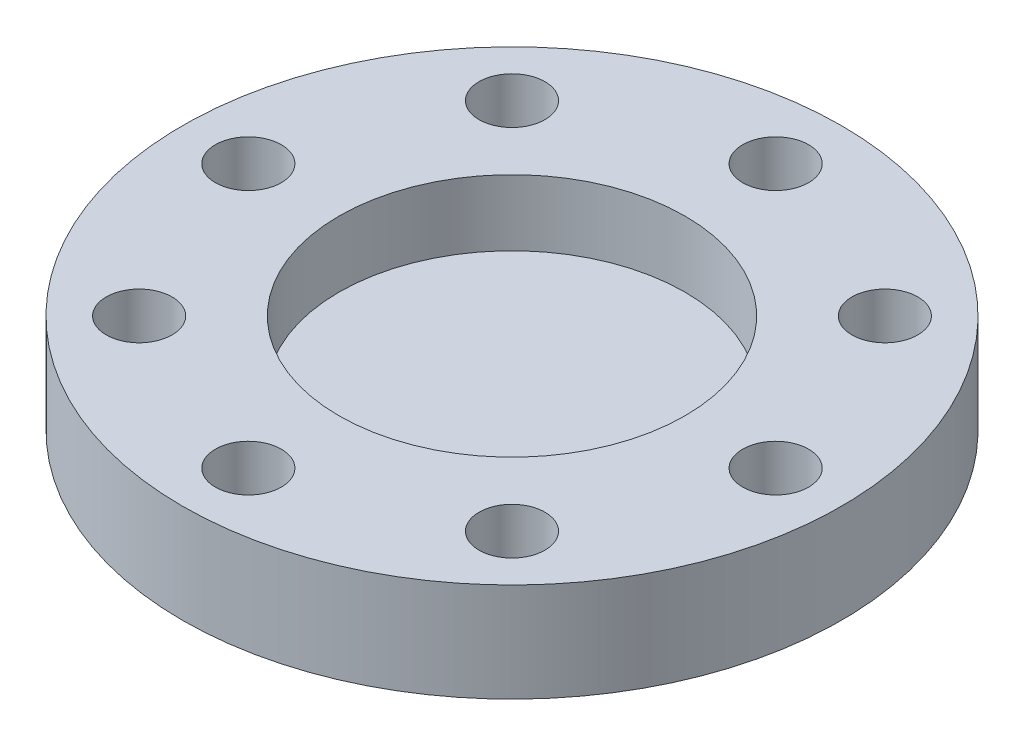
ISO-10303-21;
HEADER;
FILE_DESCRIPTION(('STEP AP214'),'2;1');
FILE_NAME('part.step','',(''),(''),'','','');
FILE_SCHEMA(('AUTOMOTIVE_DESIGN { 1 0 10303 214 1 1 1 1 }'));
ENDSEC;
DATA;
#1=APPLICATION_CONTEXT('core data for automotive mechanical design processes');
#2=APPLICATION_PROTOCOL_DEFINITION('international standard','automotive_design',2000,#1);
#3=PRODUCT_CONTEXT('',#1,'mechanical');
#4=PRODUCT('Part','Part','',(#3));
#5=PRODUCT_RELATED_PRODUCT_CATEGORY('part','',(#4));
#6=PRODUCT_DEFINITION_FORMATION('','',#4);
#7=PRODUCT_DEFINITION_CONTEXT('part definition',#1,'design');
#8=PRODUCT_DEFINITION('design','',#6,#7);
#9=PRODUCT_DEFINITION_SHAPE('','',#8);
#10=(LENGTH_UNIT() NAMED_UNIT(*) SI_UNIT(.MILLI.,.METRE.));
#11=(NAMED_UNIT(*) PLANE_ANGLE_UNIT() SI_UNIT($,.RADIAN.));
#12=(NAMED_UNIT(*) SI_UNIT($,.STERADIAN.) SOLID_ANGLE_UNIT());
#13=UNCERTAINTY_MEASURE_WITH_UNIT(LENGTH_MEASURE(1.E-05),#10,'distance_accuracy_value','');
#14=(GEOMETRIC_REPRESENTATION_CONTEXT(3) GLOBAL_UNCERTAINTY_ASSIGNED_CONTEXT((#13)) GLOBAL_UNIT_ASSIGNED_CONTEXT((#10,
#11,#12)) REPRESENTATION_CONTEXT('',''));
#15=CARTESIAN_POINT('',(0.,0.,0.));
#16=DIRECTION('',(0.,0.,1.));
#17=DIRECTION('',(1.,0.,0.));
#18=AXIS2_PLACEMENT_3D('',#15,#16,#17);
#19=CARTESIAN_POINT('',(0.,-3.,0.));
#20=DIRECTION('',(0.,1.,0.));
#21=DIRECTION('',(0.,0.,1.));
#22=AXIS2_PLACEMENT_3D('',#19,#20,#21);
#23=CYLINDRICAL_SURFACE('',#22,10.);
#24=CARTESIAN_POINT('',(0.,-3.,0.));
#25=DIRECTION('',(0.,1.,0.));
#26=DIRECTION('',(0.,0.,1.));
#27=AXIS2_PLACEMENT_3D('',#24,#25,#26);
#28=CIRCLE('',#27,10.);
#29=CARTESIAN_POINT('',(0.,-3.,10.));
#30=VERTEX_POINT('',#29);
#31=EDGE_CURVE('E10',#30,#30,#28,.T.);
#32=ORIENTED_EDGE('',*,*,#31,.T.);
#33=EDGE_LOOP('',(#32));
#34=FACE_BOUND('',#33,.T.);
#35=CARTESIAN_POINT('',(0.,0.,0.));
#36=DIRECTION('',(0.,1.,0.));
#37=DIRECTION('',(0.,0.,1.));
#38=AXIS2_PLACEMENT_3D('',#35,#36,#37);
#39=CIRCLE('',#38,10.);
#40=CARTESIAN_POINT('',(0.,0.,10.));
#41=VERTEX_POINT('',#40);
#42=EDGE_CURVE('E42',#41,#41,#39,.T.);
#43=ORIENTED_EDGE('',*,*,#42,.F.);
#44=EDGE_LOOP('',(#43));
#45=FACE_BOUND('',#44,.T.);
#46=ADVANCED_FACE('F39',(#34,#45),#23,.T.);
#47=CARTESIAN_POINT('',(0.,-3.,0.));
#48=DIRECTION('',(0.,1.,0.));
#49=DIRECTION('',(0.,0.,1.));
#50=AXIS2_PLACEMENT_3D('',#47,#48,#49);
#51=PLANE('',#50);
#52=CARTESIAN_POINT('',(-3.39590937005871E-13,-3.,-8.));
#53=DIRECTION('',(0.,1.,0.));
#54=DIRECTION('',(0.,0.,1.));
#55=AXIS2_PLACEMENT_3D('',#52,#53,#54);
#56=CIRCLE('',#55,1.);
#57=CARTESIAN_POINT('',(-3.39590937005871E-13,-3.,-7.));
#58=VERTEX_POINT('',#57);
#59=EDGE_CURVE('E57',#58,#58,#56,.T.);
#60=ORIENTED_EDGE('',*,*,#59,.T.);
#61=EDGE_LOOP('',(#60));
#62=FACE_BOUND('',#61,.T.);
#63=CARTESIAN_POINT('',(5.65685424949214,-3.,-5.65685424949262));
#64=DIRECTION('',(0.,1.,0.));
#65=DIRECTION('',(0.,0.,1.));
#66=AXIS2_PLACEMENT_3D('',#63,#64,#65);
#67=CIRCLE('',#66,1.);
#68=CARTESIAN_POINT('',(5.65685424949214,-3.,-4.65685424949262));
#69=VERTEX_POINT('',#68);
#70=EDGE_CURVE('E113',#69,#69,#67,.T.);
#71=ORIENTED_EDGE('',*,*,#70,.T.);
#72=EDGE_LOOP('',(#71));
#73=FACE_BOUND('',#72,.T.);
#74=CARTESIAN_POINT('',(8.,-3.,-3.40060011400078E-13));
#75=DIRECTION('',(0.,1.,0.));
#76=DIRECTION('',(0.,0.,1.));
#77=AXIS2_PLACEMENT_3D('',#74,#75,#76);
#78=CIRCLE('',#77,1.);
#79=CARTESIAN_POINT('',(8.,-3.,0.999999999999661));
#80=VERTEX_POINT('',#79);
#81=EDGE_CURVE('E105',#80,#80,#78,.T.);
#82=ORIENTED_EDGE('',*,*,#81,.T.);
#83=EDGE_LOOP('',(#82));
#84=FACE_BOUND('',#83,.T.);
#85=CARTESIAN_POINT('',(5.65685424949262,-3.,5.65685424949214));
#86=DIRECTION('',(0.,1.,0.));
#87=DIRECTION('',(0.,0.,1.));
#88=AXIS2_PLACEMENT_3D('',#85,#86,#87);
#89=CIRCLE('',#88,0.999999999999999);
#90=CARTESIAN_POINT('',(5.65685424949262,-3.,6.65685424949214));
#91=VERTEX_POINT('',#90);
#92=EDGE_CURVE('E97',#91,#91,#89,.T.);
#93=ORIENTED_EDGE('',*,*,#92,.T.);
#94=EDGE_LOOP('',(#93));
#95=FACE_BOUND('',#94,.T.);
#96=CARTESIAN_POINT('',(3.39590937005871E-13,-3.,8.));
#97=DIRECTION('',(0.,1.,0.));
#98=DIRECTION('',(0.,0.,1.));
#99=AXIS2_PLACEMENT_3D('',#96,#97,#98);
#100=CIRCLE('',#99,1.);
#101=CARTESIAN_POINT('',(3.39590937005871E-13,-3.,9.));
#102=VERTEX_POINT('',#101);
#103=EDGE_CURVE('E89',#102,#102,#100,.T.);
#104=ORIENTED_EDGE('',*,*,#103,.T.);
#105=EDGE_LOOP('',(#104));
#106=FACE_BOUND('',#105,.T.);
#107=CARTESIAN_POINT('',(-5.65685424949214,-3.,5.65685424949262));
#108=DIRECTION('',(0.,1.,0.));
#109=DIRECTION('',(0.,0.,1.));
#110=AXIS2_PLACEMENT_3D('',#107,#108,#109);
#111=CIRCLE('',#110,1.);
#112=CARTESIAN_POINT('',(-5.65685424949214,-3.,6.65685424949262));
#113=VERTEX_POINT('',#112);
#114=EDGE_CURVE('E81',#113,#113,#111,.T.);
#115=ORIENTED_EDGE('',*,*,#114,.T.);
#116=EDGE_LOOP('',(#115));
#117=FACE_BOUND('',#116,.T.);
#118=CARTESIAN_POINT('',(-8.,-3.,3.41035793355315E-13));
#119=DIRECTION('',(0.,1.,0.));
#120=DIRECTION('',(0.,0.,1.));
#121=AXIS2_PLACEMENT_3D('',#118,#119,#120);
#122=CIRCLE('',#121,1.);
#123=CARTESIAN_POINT('',(-8.,-3.,1.00000000000034));
#124=VERTEX_POINT('',#123);
#125=EDGE_CURVE('E73',#124,#124,#122,.T.);
#126=ORIENTED_EDGE('',*,*,#125,.T.);
#127=EDGE_LOOP('',(#126));
#128=FACE_BOUND('',#127,.T.);
#129=CARTESIAN_POINT('',(-5.65685424949262,-3.,-5.65685424949214));
#130=DIRECTION('',(0.,1.,0.));
#131=DIRECTION('',(0.,0.,1.));
#132=AXIS2_PLACEMENT_3D('',#129,#130,#131);
#133=CIRCLE('',#132,1.);
#134=CARTESIAN_POINT('',(-5.65685424949262,-3.,-4.65685424949214));
#135=VERTEX_POINT('',#134);
#136=EDGE_CURVE('E65',#135,#135,#133,.T.);
#137=ORIENTED_EDGE('',*,*,#136,.T.);
#138=EDGE_LOOP('',(#137));
#139=FACE_BOUND('',#138,.T.);
#140=ORIENTED_EDGE('',*,*,#31,.F.);
#141=EDGE_LOOP('',(#140));
#142=FACE_BOUND('',#141,.T.);
#143=ADVANCED_FACE('F125',(#62,#73,#84,#95,#106,#117,#128,#139,#142),#51,.F.);
#144=CARTESIAN_POINT('',(0.,0.,0.));
#145=DIRECTION('',(0.,1.,0.));
#146=DIRECTION('',(0.,0.,1.));
#147=AXIS2_PLACEMENT_3D('',#144,#145,#146);
#148=PLANE('',#147);
#149=CARTESIAN_POINT('',(-3.39590937005871E-13,0.,-8.));
#150=DIRECTION('',(0.,1.,0.));
#151=DIRECTION('',(0.,0.,1.));
#152=AXIS2_PLACEMENT_3D('',#149,#150,#151);
#153=CIRCLE('',#152,1.);
#154=CARTESIAN_POINT('',(-3.39590937005871E-13,0.,-7.));
#155=VERTEX_POINT('',#154);
#156=EDGE_CURVE('E117',#155,#155,#153,.T.);
#157=ORIENTED_EDGE('',*,*,#156,.F.);
#158=EDGE_LOOP('',(#157));
#159=FACE_BOUND('',#158,.T.);
#160=CARTESIAN_POINT('',(5.65685424949214,0.,-5.65685424949262));
#161=DIRECTION('',(0.,1.,0.));
#162=DIRECTION('',(0.,0.,1.));
#163=AXIS2_PLACEMENT_3D('',#160,#161,#162);
#164=CIRCLE('',#163,1.);
#165=CARTESIAN_POINT('',(5.65685424949214,0.,-4.65685424949262));
#166=VERTEX_POINT('',#165);
#167=EDGE_CURVE('E109',#166,#166,#164,.T.);
#168=ORIENTED_EDGE('',*,*,#167,.F.);
#169=EDGE_LOOP('',(#168));
#170=FACE_BOUND('',#169,.T.);
#171=CARTESIAN_POINT('',(8.,0.,-3.40060011400078E-13));
#172=DIRECTION('',(0.,1.,0.));
#173=DIRECTION('',(0.,0.,1.));
#174=AXIS2_PLACEMENT_3D('',#171,#172,#173);
#175=CIRCLE('',#174,1.);
#176=CARTESIAN_POINT('',(8.,0.,0.999999999999661));
#177=VERTEX_POINT('',#176);
#178=EDGE_CURVE('E101',#177,#177,#175,.T.);
#179=ORIENTED_EDGE('',*,*,#178,.F.);
#180=EDGE_LOOP('',(#179));
#181=FACE_BOUND('',#180,.T.);
#182=CARTESIAN_POINT('',(5.65685424949262,0.,5.65685424949214));
#183=DIRECTION('',(0.,1.,0.));
#184=DIRECTION('',(0.,0.,1.));
#185=AXIS2_PLACEMENT_3D('',#182,#183,#184);
#186=CIRCLE('',#185,0.999999999999999);
#187=CARTESIAN_POINT('',(5.65685424949262,0.,6.65685424949214));
#188=VERTEX_POINT('',#187);
#189=EDGE_CURVE('E93',#188,#188,#186,.T.);
#190=ORIENTED_EDGE('',*,*,#189,.F.);
#191=EDGE_LOOP('',(#190));
#192=FACE_BOUND('',#191,.T.);
#193=CARTESIAN_POINT('',(3.39590937005871E-13,0.,8.));
#194=DIRECTION('',(0.,1.,0.));
#195=DIRECTION('',(0.,0.,1.));
#196=AXIS2_PLACEMENT_3D('',#193,#194,#195);
#197=CIRCLE('',#196,1.);
#198=CARTESIAN_POINT('',(3.39590937005871E-13,0.,9.));
#199=VERTEX_POINT('',#198);
#200=EDGE_CURVE('E85',#199,#199,#197,.T.);
#201=ORIENTED_EDGE('',*,*,#200,.F.);
#202=EDGE_LOOP('',(#201));
#203=FACE_BOUND('',#202,.T.);
#204=CARTESIAN_POINT('',(-5.65685424949214,0.,5.65685424949262));
#205=DIRECTION('',(0.,1.,0.));
#206=DIRECTION('',(0.,0.,1.));
#207=AXIS2_PLACEMENT_3D('',#204,#205,#206);
#208=CIRCLE('',#207,1.);
#209=CARTESIAN_POINT('',(-5.65685424949214,0.,6.65685424949262));
#210=VERTEX_POINT('',#209);
#211=EDGE_CURVE('E77',#210,#210,#208,.T.);
#212=ORIENTED_EDGE('',*,*,#211,.F.);
#213=EDGE_LOOP('',(#212));
#214=FACE_BOUND('',#213,.T.);
#215=CARTESIAN_POINT('',(-8.,0.,3.41035793355315E-13));
#216=DIRECTION('',(0.,1.,0.));
#217=DIRECTION('',(0.,0.,1.));
#218=AXIS2_PLACEMENT_3D('',#215,#216,#217);
#219=CIRCLE('',#218,1.);
#220=CARTESIAN_POINT('',(-8.,0.,1.00000000000034));
#221=VERTEX_POINT('',#220);
#222=EDGE_CURVE('E69',#221,#221,#219,.T.);
#223=ORIENTED_EDGE('',*,*,#222,.F.);
#224=EDGE_LOOP('',(#223));
#225=FACE_BOUND('',#224,.T.);
#226=CARTESIAN_POINT('',(-5.65685424949262,0.,-5.65685424949214));
#227=DIRECTION('',(0.,1.,0.));
#228=DIRECTION('',(0.,0.,1.));
#229=AXIS2_PLACEMENT_3D('',#226,#227,#228);
#230=CIRCLE('',#229,1.);
#231=CARTESIAN_POINT('',(-5.65685424949262,0.,-4.65685424949214));
#232=VERTEX_POINT('',#231);
#233=EDGE_CURVE('E61',#232,#232,#230,.T.);
#234=ORIENTED_EDGE('',*,*,#233,.F.);
#235=EDGE_LOOP('',(#234));
#236=FACE_BOUND('',#235,.T.);
#237=CARTESIAN_POINT('',(0.,0.,0.));
#238=DIRECTION('',(0.,1.,0.));
#239=DIRECTION('',(0.,0.,1.));
#240=AXIS2_PLACEMENT_3D('',#237,#238,#239);
#241=CIRCLE('',#240,5.25);
#242=CARTESIAN_POINT('',(0.,0.,5.25));
#243=VERTEX_POINT('',#242);
#244=EDGE_CURVE('E53',#243,#243,#241,.T.);
#245=ORIENTED_EDGE('',*,*,#244,.F.);
#246=EDGE_LOOP('',(#245));
#247=FACE_BOUND('',#246,.T.);
#248=ORIENTED_EDGE('',*,*,#42,.T.);
#249=EDGE_LOOP('',(#248));
#250=FACE_BOUND('',#249,.T.);
#251=ADVANCED_FACE('F135',(#159,#170,#181,#192,#203,#214,#225,#236,#247,#250),#148,.T.);
#252=CARTESIAN_POINT('',(0.,-2.,0.));
#253=DIRECTION('',(0.,1.,0.));
#254=DIRECTION('',(0.,0.,1.));
#255=AXIS2_PLACEMENT_3D('',#252,#253,#254);
#256=CYLINDRICAL_SURFACE('',#255,5.25);
#257=CARTESIAN_POINT('',(0.,-2.,0.));
#258=DIRECTION('',(0.,1.,0.));
#259=DIRECTION('',(0.,0.,1.));
#260=AXIS2_PLACEMENT_3D('',#257,#258,#259);
#261=CIRCLE('',#260,5.25);
#262=CARTESIAN_POINT('',(0.,-2.,5.25));
#263=VERTEX_POINT('',#262);
#264=EDGE_CURVE('E51',#263,#263,#261,.T.);
#265=ORIENTED_EDGE('',*,*,#264,.F.);
#266=EDGE_LOOP('',(#265));
#267=FACE_BOUND('',#266,.T.);
#268=ORIENTED_EDGE('',*,*,#244,.T.);
#269=EDGE_LOOP('',(#268));
#270=FACE_BOUND('',#269,.T.);
#271=ADVANCED_FACE('F138',(#267,#270),#256,.F.);
#272=CARTESIAN_POINT('',(0.,-2.,0.));
#273=DIRECTION('',(0.,1.,0.));
#274=DIRECTION('',(0.,0.,1.));
#275=AXIS2_PLACEMENT_3D('',#272,#273,#274);
#276=PLANE('',#275);
#277=ORIENTED_EDGE('',*,*,#264,.T.);
#278=EDGE_LOOP('',(#277));
#279=FACE_BOUND('',#278,.T.);
#280=ADVANCED_FACE('F167',(#279),#276,.T.);
#281=CARTESIAN_POINT('',(-5.65685424949262,-3.,-5.65685424949214));
#282=DIRECTION('',(0.,1.,0.));
#283=DIRECTION('',(0.,0.,1.));
#284=AXIS2_PLACEMENT_3D('',#281,#282,#283);
#285=CYLINDRICAL_SURFACE('',#284,1.);
#286=ORIENTED_EDGE('',*,*,#136,.F.);
#287=EDGE_LOOP('',(#286));
#288=FACE_BOUND('',#287,.T.);
#289=ORIENTED_EDGE('',*,*,#233,.T.);
#290=EDGE_LOOP('',(#289));
#291=FACE_BOUND('',#290,.T.);
#292=ADVANCED_FACE('F171',(#288,#291),#285,.F.);
#293=CARTESIAN_POINT('',(-8.,-3.,3.41035793355315E-13));
#294=DIRECTION('',(0.,1.,0.));
#295=DIRECTION('',(0.,0.,1.));
#296=AXIS2_PLACEMENT_3D('',#293,#294,#295);
#297=CYLINDRICAL_SURFACE('',#296,1.);
#298=ORIENTED_EDGE('',*,*,#125,.F.);
#299=EDGE_LOOP('',(#298));
#300=FACE_BOUND('',#299,.T.);
#301=ORIENTED_EDGE('',*,*,#222,.T.);
#302=EDGE_LOOP('',(#301));
#303=FACE_BOUND('',#302,.T.);
#304=ADVANCED_FACE('F175',(#300,#303),#297,.F.);
#305=CARTESIAN_POINT('',(-5.65685424949214,-3.,5.65685424949262));
#306=DIRECTION('',(0.,1.,0.));
#307=DIRECTION('',(0.,0.,1.));
#308=AXIS2_PLACEMENT_3D('',#305,#306,#307);
#309=CYLINDRICAL_SURFACE('',#308,1.);
#310=ORIENTED_EDGE('',*,*,#114,.F.);
#311=EDGE_LOOP('',(#310));
#312=FACE_BOUND('',#311,.T.);
#313=ORIENTED_EDGE('',*,*,#211,.T.);
#314=EDGE_LOOP('',(#313));
#315=FACE_BOUND('',#314,.T.);
#316=ADVANCED_FACE('F179',(#312,#315),#309,.F.);
#317=CARTESIAN_POINT('',(3.39590937005871E-13,-3.,8.));
#318=DIRECTION('',(0.,1.,0.));
#319=DIRECTION('',(0.,0.,1.));
#320=AXIS2_PLACEMENT_3D('',#317,#318,#319);
#321=CYLINDRICAL_SURFACE('',#320,1.);
#322=ORIENTED_EDGE('',*,*,#103,.F.);
#323=EDGE_LOOP('',(#322));
#324=FACE_BOUND('',#323,.T.);
#325=ORIENTED_EDGE('',*,*,#200,.T.);
#326=EDGE_LOOP('',(#325));
#327=FACE_BOUND('',#326,.T.);
#328=ADVANCED_FACE('F183',(#324,#327),#321,.F.);
#329=CARTESIAN_POINT('',(5.65685424949262,-3.,5.65685424949214));
#330=DIRECTION('',(0.,1.,0.));
#331=DIRECTION('',(0.,0.,1.));
#332=AXIS2_PLACEMENT_3D('',#329,#330,#331);
#333=CYLINDRICAL_SURFACE('',#332,0.999999999999999);
#334=ORIENTED_EDGE('',*,*,#92,.F.);
#335=EDGE_LOOP('',(#334));
#336=FACE_BOUND('',#335,.T.);
#337=ORIENTED_EDGE('',*,*,#189,.T.);
#338=EDGE_LOOP('',(#337));
#339=FACE_BOUND('',#338,.T.);
#340=ADVANCED_FACE('F187',(#336,#339),#333,.F.);
#341=CARTESIAN_POINT('',(8.,-3.,-3.40060011400078E-13));
#342=DIRECTION('',(0.,1.,0.));
#343=DIRECTION('',(0.,0.,1.));
#344=AXIS2_PLACEMENT_3D('',#341,#342,#343);
#345=CYLINDRICAL_SURFACE('',#344,1.);
#346=ORIENTED_EDGE('',*,*,#81,.F.);
#347=EDGE_LOOP('',(#346));
#348=FACE_BOUND('',#347,.T.);
#349=ORIENTED_EDGE('',*,*,#178,.T.);
#350=EDGE_LOOP('',(#349));
#351=FACE_BOUND('',#350,.T.);
#352=ADVANCED_FACE('F191',(#348,#351),#345,.F.);
#353=CARTESIAN_POINT('',(5.65685424949214,-3.,-5.65685424949262));
#354=DIRECTION('',(0.,1.,0.));
#355=DIRECTION('',(0.,0.,1.));
#356=AXIS2_PLACEMENT_3D('',#353,#354,#355);
#357=CYLINDRICAL_SURFACE('',#356,1.);
#358=ORIENTED_EDGE('',*,*,#70,.F.);
#359=EDGE_LOOP('',(#358));
#360=FACE_BOUND('',#359,.T.);
#361=ORIENTED_EDGE('',*,*,#167,.T.);
#362=EDGE_LOOP('',(#361));
#363=FACE_BOUND('',#362,.T.);
#364=ADVANCED_FACE('F131',(#360,#363),#357,.F.);
#365=CARTESIAN_POINT('',(-3.39590937005871E-13,-3.,-8.));
#366=DIRECTION('',(0.,1.,0.));
#367=DIRECTION('',(0.,0.,1.));
#368=AXIS2_PLACEMENT_3D('',#365,#366,#367);
#369=CYLINDRICAL_SURFACE('',#368,1.);
#370=ORIENTED_EDGE('',*,*,#59,.F.);
#371=EDGE_LOOP('',(#370));
#372=FACE_BOUND('',#371,.T.);
#373=ORIENTED_EDGE('',*,*,#156,.T.);
#374=EDGE_LOOP('',(#373));
#375=FACE_BOUND('',#374,.T.);
#376=ADVANCED_FACE('F128',(#372,#375),#369,.F.);
#377=CLOSED_SHELL('',(#46,#143,#251,#271,#280,#292,#304,#316,#328,#340,#352,#364,#376));
#378=MANIFOLD_SOLID_BREP('B2',#377);
#379=ADVANCED_BREP_SHAPE_REPRESENTATION('',(#18,#378),#14);
#380=SHAPE_DEFINITION_REPRESENTATION(#9,#379);
ENDSEC;
END-ISO-10303-21;
